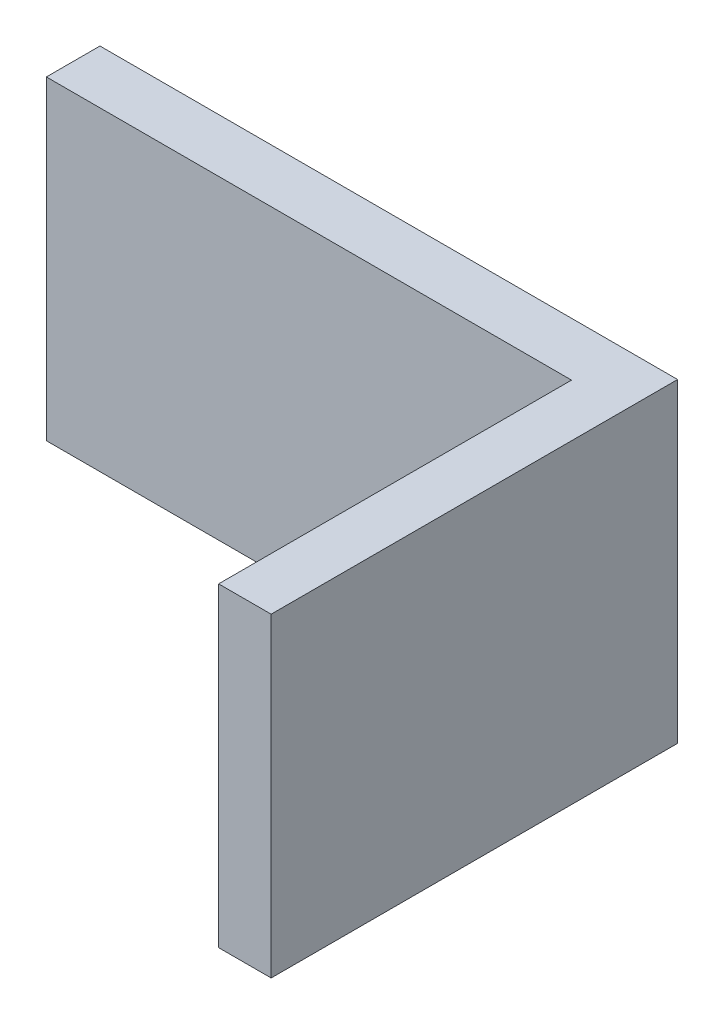
ISO-10303-21;
HEADER;
FILE_DESCRIPTION(('STEP AP214'),'2;1');
FILE_NAME('part.step','',(''),(''),'','','');
FILE_SCHEMA(('AUTOMOTIVE_DESIGN { 1 0 10303 214 1 1 1 1 }'));
ENDSEC;
DATA;
#1=APPLICATION_CONTEXT('core data for automotive mechanical design processes');
#2=APPLICATION_PROTOCOL_DEFINITION('international standard','automotive_design',2000,#1);
#3=PRODUCT_CONTEXT('',#1,'mechanical');
#4=PRODUCT('Part','Part','',(#3));
#5=PRODUCT_RELATED_PRODUCT_CATEGORY('part','',(#4));
#6=PRODUCT_DEFINITION_FORMATION('','',#4);
#7=PRODUCT_DEFINITION_CONTEXT('part definition',#1,'design');
#8=PRODUCT_DEFINITION('design','',#6,#7);
#9=PRODUCT_DEFINITION_SHAPE('','',#8);
#10=(LENGTH_UNIT() NAMED_UNIT(*) SI_UNIT(.MILLI.,.METRE.));
#11=(NAMED_UNIT(*) PLANE_ANGLE_UNIT() SI_UNIT($,.RADIAN.));
#12=(NAMED_UNIT(*) SI_UNIT($,.STERADIAN.) SOLID_ANGLE_UNIT());
#13=UNCERTAINTY_MEASURE_WITH_UNIT(LENGTH_MEASURE(1.E-05),#10,'distance_accuracy_value','');
#14=(GEOMETRIC_REPRESENTATION_CONTEXT(3) GLOBAL_UNCERTAINTY_ASSIGNED_CONTEXT((#13)) GLOBAL_UNIT_ASSIGNED_CONTEXT((#10,
#11,#12)) REPRESENTATION_CONTEXT('',''));
#15=CARTESIAN_POINT('',(0.,0.,0.));
#16=DIRECTION('',(0.,0.,1.));
#17=DIRECTION('',(1.,0.,0.));
#18=AXIS2_PLACEMENT_3D('',#15,#16,#17);
#19=CARTESIAN_POINT('',(4.55,2.4,0.));
#20=DIRECTION('',(0.,1.,0.));
#21=DIRECTION('',(0.,0.,1.));
#22=AXIS2_PLACEMENT_3D('',#19,#20,#21);
#23=PLANE('',#22);
#24=DIRECTION('',(1.,0.,0.));
#25=VECTOR('',#24,1.);
#26=CARTESIAN_POINT('',(4.,2.4,0.));
#27=LINE('',#26,#25);
#28=CARTESIAN_POINT('',(4.,2.4,0.));
#29=VERTEX_POINT('',#28);
#30=CARTESIAN_POINT('',(4.55,2.4,0.));
#31=VERTEX_POINT('',#30);
#32=EDGE_CURVE('E11',#29,#31,#27,.T.);
#33=ORIENTED_EDGE('',*,*,#32,.F.);
#34=DIRECTION('',(0.,0.,-1.));
#35=VECTOR('',#34,1.);
#36=CARTESIAN_POINT('',(4.,2.4,0.051));
#37=LINE('',#36,#35);
#38=CARTESIAN_POINT('',(4.,2.4,0.051));
#39=VERTEX_POINT('',#38);
#40=EDGE_CURVE('E24',#39,#29,#37,.T.);
#41=ORIENTED_EDGE('',*,*,#40,.F.);
#42=DIRECTION('',(-1.,0.,0.));
#43=VECTOR('',#42,1.);
#44=CARTESIAN_POINT('',(4.5,2.4,0.051));
#45=LINE('',#44,#43);
#46=CARTESIAN_POINT('',(4.5,2.4,0.051));
#47=VERTEX_POINT('',#46);
#48=EDGE_CURVE('E87',#47,#39,#45,.T.);
#49=ORIENTED_EDGE('',*,*,#48,.F.);
#50=DIRECTION('',(0.,0.,-1.));
#51=VECTOR('',#50,1.);
#52=CARTESIAN_POINT('',(4.5,2.4,0.387));
#53=LINE('',#52,#51);
#54=CARTESIAN_POINT('',(4.5,2.4,0.387));
#55=VERTEX_POINT('',#54);
#56=EDGE_CURVE('E114',#55,#47,#53,.T.);
#57=ORIENTED_EDGE('',*,*,#56,.F.);
#58=DIRECTION('',(-1.,0.,0.));
#59=VECTOR('',#58,1.);
#60=CARTESIAN_POINT('',(4.55,2.4,0.387));
#61=LINE('',#60,#59);
#62=CARTESIAN_POINT('',(4.55,2.4,0.387));
#63=VERTEX_POINT('',#62);
#64=EDGE_CURVE('E111',#63,#55,#61,.T.);
#65=ORIENTED_EDGE('',*,*,#64,.F.);
#66=DIRECTION('',(0.,0.,1.));
#67=VECTOR('',#66,1.);
#68=CARTESIAN_POINT('',(4.55,2.4,0.));
#69=LINE('',#68,#67);
#70=EDGE_CURVE('E108',#31,#63,#69,.T.);
#71=ORIENTED_EDGE('',*,*,#70,.F.);
#72=EDGE_LOOP('',(#33,#41,#49,#57,#65,#71));
#73=FACE_BOUND('',#72,.T.);
#74=ADVANCED_FACE('F17',(#73),#23,.T.);
#75=CARTESIAN_POINT('',(4.,2.1,0.));
#76=DIRECTION('',(0.,-1.,0.));
#77=DIRECTION('',(0.,0.,1.));
#78=AXIS2_PLACEMENT_3D('',#75,#76,#77);
#79=PLANE('',#78);
#80=DIRECTION('',(-1.,0.,0.));
#81=VECTOR('',#80,1.);
#82=CARTESIAN_POINT('',(4.55,2.1,0.));
#83=LINE('',#82,#81);
#84=CARTESIAN_POINT('',(4.55,2.1,0.));
#85=VERTEX_POINT('',#84);
#86=CARTESIAN_POINT('',(4.,2.1,0.));
#87=VERTEX_POINT('',#86);
#88=EDGE_CURVE('E106',#85,#87,#83,.T.);
#89=ORIENTED_EDGE('',*,*,#88,.F.);
#90=DIRECTION('',(0.,0.,-1.));
#91=VECTOR('',#90,1.);
#92=CARTESIAN_POINT('',(4.55,2.1,0.387));
#93=LINE('',#92,#91);
#94=CARTESIAN_POINT('',(4.55,2.1,0.387));
#95=VERTEX_POINT('',#94);
#96=EDGE_CURVE('E103',#95,#85,#93,.T.);
#97=ORIENTED_EDGE('',*,*,#96,.F.);
#98=DIRECTION('',(1.,0.,0.));
#99=VECTOR('',#98,1.);
#100=CARTESIAN_POINT('',(4.5,2.1,0.387));
#101=LINE('',#100,#99);
#102=CARTESIAN_POINT('',(4.5,2.1,0.387));
#103=VERTEX_POINT('',#102);
#104=EDGE_CURVE('E100',#103,#95,#101,.T.);
#105=ORIENTED_EDGE('',*,*,#104,.F.);
#106=DIRECTION('',(0.,0.,1.));
#107=VECTOR('',#106,1.);
#108=CARTESIAN_POINT('',(4.5,2.1,0.051));
#109=LINE('',#108,#107);
#110=CARTESIAN_POINT('',(4.5,2.1,0.051));
#111=VERTEX_POINT('',#110);
#112=EDGE_CURVE('E72',#111,#103,#109,.T.);
#113=ORIENTED_EDGE('',*,*,#112,.F.);
#114=DIRECTION('',(1.,0.,0.));
#115=VECTOR('',#114,1.);
#116=CARTESIAN_POINT('',(4.,2.1,0.051));
#117=LINE('',#116,#115);
#118=CARTESIAN_POINT('',(4.,2.1,0.051));
#119=VERTEX_POINT('',#118);
#120=EDGE_CURVE('E66',#119,#111,#117,.T.);
#121=ORIENTED_EDGE('',*,*,#120,.F.);
#122=DIRECTION('',(0.,0.,1.));
#123=VECTOR('',#122,1.);
#124=CARTESIAN_POINT('',(4.,2.1,0.));
#125=LINE('',#124,#123);
#126=EDGE_CURVE('E69',#87,#119,#125,.T.);
#127=ORIENTED_EDGE('',*,*,#126,.F.);
#128=EDGE_LOOP('',(#89,#97,#105,#113,#121,#127));
#129=FACE_BOUND('',#128,.T.);
#130=ADVANCED_FACE('F68',(#129),#79,.T.);
#131=CARTESIAN_POINT('',(4.55,2.4,0.387));
#132=DIRECTION('',(0.,0.,1.));
#133=DIRECTION('',(0.,1.,0.));
#134=AXIS2_PLACEMENT_3D('',#131,#132,#133);
#135=PLANE('',#134);
#136=ORIENTED_EDGE('',*,*,#64,.T.);
#137=DIRECTION('',(0.,1.,0.));
#138=VECTOR('',#137,1.);
#139=CARTESIAN_POINT('',(4.5,2.1,0.387));
#140=LINE('',#139,#138);
#141=EDGE_CURVE('E83',#103,#55,#140,.T.);
#142=ORIENTED_EDGE('',*,*,#141,.F.);
#143=ORIENTED_EDGE('',*,*,#104,.T.);
#144=DIRECTION('',(0.,-1.,0.));
#145=VECTOR('',#144,1.);
#146=CARTESIAN_POINT('',(4.55,2.4,0.387));
#147=LINE('',#146,#145);
#148=EDGE_CURVE('E88',#63,#95,#147,.T.);
#149=ORIENTED_EDGE('',*,*,#148,.F.);
#150=EDGE_LOOP('',(#136,#142,#143,#149));
#151=FACE_BOUND('',#150,.T.);
#152=ADVANCED_FACE('F125',(#151),#135,.T.);
#153=CARTESIAN_POINT('',(4.5,2.4,0.051));
#154=DIRECTION('',(0.,0.,1.));
#155=DIRECTION('',(0.,1.,0.));
#156=AXIS2_PLACEMENT_3D('',#153,#154,#155);
#157=PLANE('',#156);
#158=ORIENTED_EDGE('',*,*,#48,.T.);
#159=DIRECTION('',(0.,1.,0.));
#160=VECTOR('',#159,1.);
#161=CARTESIAN_POINT('',(4.,2.1,0.051));
#162=LINE('',#161,#160);
#163=EDGE_CURVE('E81',#119,#39,#162,.T.);
#164=ORIENTED_EDGE('',*,*,#163,.F.);
#165=ORIENTED_EDGE('',*,*,#120,.T.);
#166=DIRECTION('',(0.,-1.,0.));
#167=VECTOR('',#166,1.);
#168=CARTESIAN_POINT('',(4.5,2.4,0.051));
#169=LINE('',#168,#167);
#170=EDGE_CURVE('E89',#47,#111,#169,.T.);
#171=ORIENTED_EDGE('',*,*,#170,.F.);
#172=EDGE_LOOP('',(#158,#164,#165,#171));
#173=FACE_BOUND('',#172,.T.);
#174=ADVANCED_FACE('F86',(#173),#157,.T.);
#175=CARTESIAN_POINT('',(4.55,2.1,0.));
#176=DIRECTION('',(1.,0.,0.));
#177=DIRECTION('',(0.,0.,1.));
#178=AXIS2_PLACEMENT_3D('',#175,#176,#177);
#179=PLANE('',#178);
#180=DIRECTION('',(0.,-1.,0.));
#181=VECTOR('',#180,1.);
#182=CARTESIAN_POINT('',(4.55,2.4,0.));
#183=LINE('',#182,#181);
#184=EDGE_CURVE('E93',#31,#85,#183,.T.);
#185=ORIENTED_EDGE('',*,*,#184,.F.);
#186=ORIENTED_EDGE('',*,*,#70,.T.);
#187=ORIENTED_EDGE('',*,*,#148,.T.);
#188=ORIENTED_EDGE('',*,*,#96,.T.);
#189=EDGE_LOOP('',(#185,#186,#187,#188));
#190=FACE_BOUND('',#189,.T.);
#191=ADVANCED_FACE('F121',(#190),#179,.T.);
#192=CARTESIAN_POINT('',(4.,2.4,0.));
#193=DIRECTION('',(-1.,0.,0.));
#194=DIRECTION('',(0.,0.,1.));
#195=AXIS2_PLACEMENT_3D('',#192,#193,#194);
#196=PLANE('',#195);
#197=DIRECTION('',(0.,1.,0.));
#198=VECTOR('',#197,1.);
#199=CARTESIAN_POINT('',(4.,2.1,0.));
#200=LINE('',#199,#198);
#201=EDGE_CURVE('E82',#87,#29,#200,.T.);
#202=ORIENTED_EDGE('',*,*,#201,.F.);
#203=ORIENTED_EDGE('',*,*,#126,.T.);
#204=ORIENTED_EDGE('',*,*,#163,.T.);
#205=ORIENTED_EDGE('',*,*,#40,.T.);
#206=EDGE_LOOP('',(#202,#203,#204,#205));
#207=FACE_BOUND('',#206,.T.);
#208=ADVANCED_FACE('F80',(#207),#196,.T.);
#209=CARTESIAN_POINT('',(4.5,2.4,0.051));
#210=DIRECTION('',(-1.,0.,0.));
#211=DIRECTION('',(0.,0.,1.));
#212=AXIS2_PLACEMENT_3D('',#209,#210,#211);
#213=PLANE('',#212);
#214=ORIENTED_EDGE('',*,*,#170,.T.);
#215=ORIENTED_EDGE('',*,*,#112,.T.);
#216=ORIENTED_EDGE('',*,*,#141,.T.);
#217=ORIENTED_EDGE('',*,*,#56,.T.);
#218=EDGE_LOOP('',(#214,#215,#216,#217));
#219=FACE_BOUND('',#218,.T.);
#220=ADVANCED_FACE('F127',(#219),#213,.T.);
#221=CARTESIAN_POINT('',(4.55,2.1,0.));
#222=DIRECTION('',(0.,0.,-1.));
#223=DIRECTION('',(0.,1.,0.));
#224=AXIS2_PLACEMENT_3D('',#221,#222,#223);
#225=PLANE('',#224);
#226=ORIENTED_EDGE('',*,*,#88,.T.);
#227=ORIENTED_EDGE('',*,*,#201,.T.);
#228=ORIENTED_EDGE('',*,*,#32,.T.);
#229=ORIENTED_EDGE('',*,*,#184,.T.);
#230=EDGE_LOOP('',(#226,#227,#228,#229));
#231=FACE_BOUND('',#230,.T.);
#232=ADVANCED_FACE('F117',(#231),#225,.T.);
#233=CLOSED_SHELL('',(#74,#130,#152,#174,#191,#208,#220,#232));
#234=MANIFOLD_SOLID_BREP('B1',#233);
#235=ADVANCED_BREP_SHAPE_REPRESENTATION('',(#18,#234),#14);
#236=SHAPE_DEFINITION_REPRESENTATION(#9,#235);
ENDSEC;
END-ISO-10303-21;
